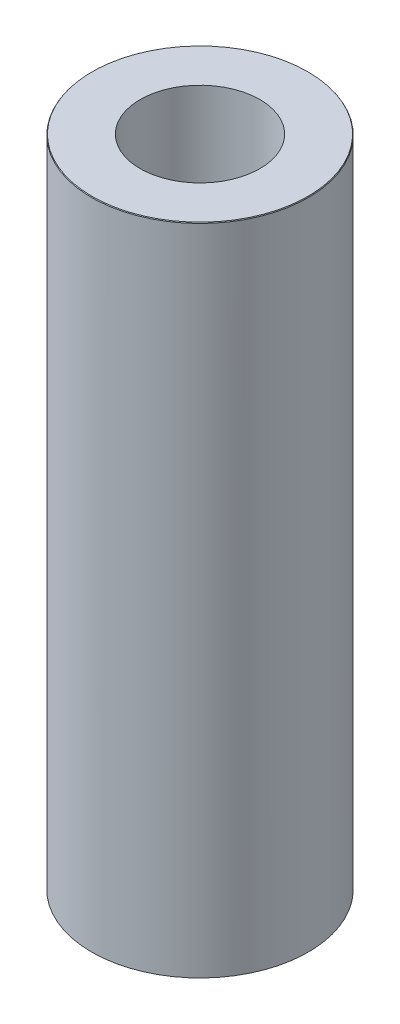
ISO-10303-21;
HEADER;
FILE_DESCRIPTION(('STEP AP214'),'2;1');
FILE_NAME('part.step','',(''),(''),'','','');
FILE_SCHEMA(('AUTOMOTIVE_DESIGN { 1 0 10303 214 1 1 1 1 }'));
ENDSEC;
DATA;
#1=APPLICATION_CONTEXT('core data for automotive mechanical design processes');
#2=APPLICATION_PROTOCOL_DEFINITION('international standard','automotive_design',2000,#1);
#3=PRODUCT_CONTEXT('',#1,'mechanical');
#4=PRODUCT('Part','Part','',(#3));
#5=PRODUCT_RELATED_PRODUCT_CATEGORY('part','',(#4));
#6=PRODUCT_DEFINITION_FORMATION('','',#4);
#7=PRODUCT_DEFINITION_CONTEXT('part definition',#1,'design');
#8=PRODUCT_DEFINITION('design','',#6,#7);
#9=PRODUCT_DEFINITION_SHAPE('','',#8);
#10=(LENGTH_UNIT() NAMED_UNIT(*) SI_UNIT(.MILLI.,.METRE.));
#11=(NAMED_UNIT(*) PLANE_ANGLE_UNIT() SI_UNIT($,.RADIAN.));
#12=(NAMED_UNIT(*) SI_UNIT($,.STERADIAN.) SOLID_ANGLE_UNIT());
#13=UNCERTAINTY_MEASURE_WITH_UNIT(LENGTH_MEASURE(1.E-05),#10,'distance_accuracy_value','');
#14=(GEOMETRIC_REPRESENTATION_CONTEXT(3) GLOBAL_UNCERTAINTY_ASSIGNED_CONTEXT((#13)) GLOBAL_UNIT_ASSIGNED_CONTEXT((#10,
#11,#12)) REPRESENTATION_CONTEXT('',''));
#15=CARTESIAN_POINT('',(0.,0.,0.));
#16=DIRECTION('',(0.,0.,1.));
#17=DIRECTION('',(1.,0.,0.));
#18=AXIS2_PLACEMENT_3D('',#15,#16,#17);
#19=CARTESIAN_POINT('',(0.,211.440433748619,0.));
#20=DIRECTION('',(0.,-1.,0.));
#21=DIRECTION('',(0.,0.,-1.));
#22=AXIS2_PLACEMENT_3D('',#19,#20,#21);
#23=CYLINDRICAL_SURFACE('',#22,35.);
#24=CARTESIAN_POINT('',(0.,211.185348429468,0.));
#25=DIRECTION('',(0.,1.,0.));
#26=DIRECTION('',(0.,0.,1.));
#27=AXIS2_PLACEMENT_3D('',#24,#25,#26);
#28=CIRCLE('',#27,35.);
#29=CARTESIAN_POINT('',(0.,211.185348429468,-35.));
#30=VERTEX_POINT('',#29);
#31=EDGE_CURVE('E50',#30,#30,#28,.F.);
#32=CARTESIAN_POINT('',(0.,0.14727357767827,0.));
#33=DIRECTION('',(0.,1.,0.));
#34=DIRECTION('',(0.,0.,1.));
#35=AXIS2_PLACEMENT_3D('',#32,#33,#34);
#36=CIRCLE('',#35,35.);
#37=CARTESIAN_POINT('',(0.,0.147273577678242,-35.));
#38=VERTEX_POINT('',#37);
#39=EDGE_CURVE('E51',#38,#38,#36,.T.);
#40=CARTESIAN_POINT('',(0.,211.185348429468,-35.));
#41=CARTESIAN_POINT('',(0.,208.987035149762,-35.));
#42=CARTESIAN_POINT('',(0.,206.788721870056,-35.));
#43=CARTESIAN_POINT('',(0.,202.392095310644,-35.));
#44=CARTESIAN_POINT('',(0.,200.193782030937,-35.));
#45=CARTESIAN_POINT('',(0.,195.797155471525,-35.));
#46=CARTESIAN_POINT('',(0.,193.598842191819,-35.));
#47=CARTESIAN_POINT('',(0.,189.202215632407,-35.));
#48=CARTESIAN_POINT('',(0.,187.003902352701,-35.));
#49=CARTESIAN_POINT('',(0.,182.607275793288,-35.));
#50=CARTESIAN_POINT('',(0.,180.408962513582,-35.));
#51=CARTESIAN_POINT('',(0.,176.01233595417,-35.));
#52=CARTESIAN_POINT('',(0.,173.814022674464,-35.));
#53=CARTESIAN_POINT('',(0.,169.417396115051,-35.));
#54=CARTESIAN_POINT('',(0.,167.219082835345,-35.));
#55=CARTESIAN_POINT('',(0.,162.822456275933,-35.));
#56=CARTESIAN_POINT('',(0.,160.624142996227,-35.));
#57=CARTESIAN_POINT('',(0.,156.227516436815,-35.));
#58=CARTESIAN_POINT('',(0.,154.029203157108,-35.));
#59=CARTESIAN_POINT('',(0.,149.632576597696,-35.));
#60=CARTESIAN_POINT('',(0.,147.43426331799,-35.));
#61=CARTESIAN_POINT('',(0.,143.037636758578,-35.));
#62=CARTESIAN_POINT('',(0.,140.839323478872,-35.));
#63=CARTESIAN_POINT('',(0.,136.442696919459,-35.));
#64=CARTESIAN_POINT('',(0.,134.244383639753,-35.));
#65=CARTESIAN_POINT('',(0.,129.847757080341,-35.));
#66=CARTESIAN_POINT('',(0.,127.649443800635,-35.));
#67=CARTESIAN_POINT('',(0.,123.252817241222,-35.));
#68=CARTESIAN_POINT('',(0.,121.054503961516,-35.));
#69=CARTESIAN_POINT('',(0.,116.657877402104,-35.));
#70=CARTESIAN_POINT('',(0.,114.459564122398,-35.));
#71=CARTESIAN_POINT('',(0.,110.062937562985,-35.));
#72=CARTESIAN_POINT('',(0.,107.864624283279,-35.));
#73=CARTESIAN_POINT('',(0.,103.467997723867,-35.));
#74=CARTESIAN_POINT('',(0.,101.269684444161,-35.));
#75=CARTESIAN_POINT('',(0.,96.8730578847486,-35.));
#76=CARTESIAN_POINT('',(0.,94.6747446050424,-35.));
#77=CARTESIAN_POINT('',(0.,90.2781180456302,-35.));
#78=CARTESIAN_POINT('',(0.,88.079804765924,-35.));
#79=CARTESIAN_POINT('',(0.,83.6831782065117,-35.));
#80=CARTESIAN_POINT('',(0.,81.4848649268056,-35.));
#81=CARTESIAN_POINT('',(0.,77.0882383673933,-35.));
#82=CARTESIAN_POINT('',(0.,74.8899250876872,-35.));
#83=CARTESIAN_POINT('',(0.,70.4932985282749,-35.));
#84=CARTESIAN_POINT('',(0.,68.2949852485687,-35.));
#85=CARTESIAN_POINT('',(0.,63.8983586891564,-35.));
#86=CARTESIAN_POINT('',(0.,61.7000454094503,-35.));
#87=CARTESIAN_POINT('',(0.,57.303418850038,-35.));
#88=CARTESIAN_POINT('',(0.,55.1051055703319,-35.));
#89=CARTESIAN_POINT('',(0.,50.7084790109196,-35.));
#90=CARTESIAN_POINT('',(0.,48.5101657312134,-35.));
#91=CARTESIAN_POINT('',(0.,44.1135391718011,-35.));
#92=CARTESIAN_POINT('',(0.,41.915225892095,-35.));
#93=CARTESIAN_POINT('',(0.,37.5185993326827,-35.));
#94=CARTESIAN_POINT('',(0.,35.3202860529765,-35.));
#95=CARTESIAN_POINT('',(0.,30.9236594935643,-35.));
#96=CARTESIAN_POINT('',(0.,28.7253462138581,-35.));
#97=CARTESIAN_POINT('',(0.,24.3287196544458,-35.));
#98=CARTESIAN_POINT('',(0.,22.1304063747397,-35.));
#99=CARTESIAN_POINT('',(0.,17.7337798153274,-35.));
#100=CARTESIAN_POINT('',(0.,15.5354665356212,-35.));
#101=CARTESIAN_POINT('',(0.,11.138839976209,-35.));
#102=CARTESIAN_POINT('',(0.,8.9405266965028,-35.));
#103=CARTESIAN_POINT('',(0.,4.54390013709051,-35.));
#104=CARTESIAN_POINT('',(0.,2.34558685738438,-35.));
#105=CARTESIAN_POINT('',(0.,0.147273577678242,-35.));
#106=B_SPLINE_CURVE_WITH_KNOTS('',3,(#40,#41,#42,#43,#44,#45,#46,#47,#48,#49,#50,#51,#52,#53,
#54,#55,#56,#57,#58,#59,#60,#61,#62,#63,#64,#65,#66,#67,#68,#69,#70,#71,#72,#73,#74,#75,#76,#77,
#78,#79,#80,#81,#82,#83,#84,#85,#86,#87,#88,#89,#90,#91,#92,#93,#94,#95,#96,#97,#98,#99,#100,
#101,#102,#103,#104,#105),.UNSPECIFIED.,.F.,.F.,(4,2,2,2,2,2,2,2,2,2,2,2,2,2,2,2,2,2,2,2,2,2,2,
2,2,2,2,2,2,2,2,2,4),(0.,6.59493983911844,13.1898796782369,19.7848195173553,26.3797593564737,
32.9746991955922,39.5696390347106,46.1645788738291,52.7595187129475,59.3544585520659,
65.9493983911844,72.5443382303028,79.1392780694212,85.7342179085397,92.3291577476581,
98.9240975867765,105.519037425895,112.113977265013,118.708917104132,125.30385694325,
131.898796782369,138.493736621487,145.088676460606,151.683616299724,158.278556138842,
164.873495977961,171.468435817079,178.063375656198,184.658315495316,191.253255334435,
197.848195173553,204.443135012671,211.03807485179),.UNSPECIFIED.);
#107=EDGE_CURVE('BSEAM39',#30,#38,#106,.T.);
#108=ORIENTED_EDGE('',*,*,#31,.T.);
#109=ORIENTED_EDGE('',*,*,#39,.T.);
#110=ORIENTED_EDGE('',*,*,#107,.T.);
#111=ORIENTED_EDGE('',*,*,#107,.F.);
#112=EDGE_LOOP('',(#108,#110,#109,#111));
#113=FACE_BOUND('',#112,.T.);
#114=ADVANCED_FACE('F39',(#113),#23,.T.);
#115=CARTESIAN_POINT('',(0.,211.440433748619,0.));
#116=DIRECTION('',(0.,1.,0.));
#117=DIRECTION('',(0.,0.,1.));
#118=AXIS2_PLACEMENT_3D('',#115,#116,#117);
#119=PLANE('',#118);
#120=CARTESIAN_POINT('',(0.,211.440433748619,0.));
#121=DIRECTION('',(0.,1.,0.));
#122=DIRECTION('',(0.,0.,1.));
#123=AXIS2_PLACEMENT_3D('',#120,#121,#122);
#124=CIRCLE('',#123,34.8527264223219);
#125=CARTESIAN_POINT('',(0.,211.440433748619,34.8527264223219));
#126=VERTEX_POINT('',#125);
#127=EDGE_CURVE('E54',#126,#126,#124,.T.);
#128=ORIENTED_EDGE('',*,*,#127,.T.);
#129=EDGE_LOOP('',(#128));
#130=FACE_BOUND('',#129,.T.);
#131=CARTESIAN_POINT('',(0.,211.440433748619,0.));
#132=DIRECTION('',(0.,1.,0.));
#133=DIRECTION('',(0.,0.,1.));
#134=AXIS2_PLACEMENT_3D('',#131,#132,#133);
#135=CIRCLE('',#134,19.3418650010805);
#136=CARTESIAN_POINT('',(0.,211.440433748619,-19.3418650010805));
#137=VERTEX_POINT('',#136);
#138=EDGE_CURVE('E58',#137,#137,#135,.T.);
#139=ORIENTED_EDGE('',*,*,#138,.F.);
#140=EDGE_LOOP('',(#139));
#141=FACE_BOUND('',#140,.T.);
#142=ADVANCED_FACE('F69',(#130,#141),#119,.T.);
#143=CARTESIAN_POINT('',(0.,0.,0.));
#144=DIRECTION('',(0.,1.,0.));
#145=DIRECTION('',(0.,0.,1.));
#146=AXIS2_PLACEMENT_3D('',#143,#144,#145);
#147=PLANE('',#146);
#148=CARTESIAN_POINT('',(0.,0.,0.));
#149=DIRECTION('',(0.,1.,0.));
#150=DIRECTION('',(0.,0.,1.));
#151=AXIS2_PLACEMENT_3D('',#148,#149,#150);
#152=CIRCLE('',#151,34.7449146808488);
#153=CARTESIAN_POINT('',(0.,0.,34.7449146808488));
#154=VERTEX_POINT('',#153);
#155=EDGE_CURVE('E10',#154,#154,#152,.F.);
#156=ORIENTED_EDGE('',*,*,#155,.T.);
#157=EDGE_LOOP('',(#156));
#158=FACE_BOUND('',#157,.T.);
#159=CARTESIAN_POINT('',(0.,0.,0.));
#160=DIRECTION('',(0.,1.,0.));
#161=DIRECTION('',(0.,0.,1.));
#162=AXIS2_PLACEMENT_3D('',#159,#160,#161);
#163=CIRCLE('',#162,19.3418650010805);
#164=CARTESIAN_POINT('',(0.,0.,-19.3418650010805));
#165=VERTEX_POINT('',#164);
#166=EDGE_CURVE('E63',#165,#165,#163,.T.);
#167=ORIENTED_EDGE('',*,*,#166,.T.);
#168=EDGE_LOOP('',(#167));
#169=FACE_BOUND('',#168,.T.);
#170=ADVANCED_FACE('F75',(#158,#169),#147,.F.);
#171=CARTESIAN_POINT('',(0.,211.440433748619,0.));
#172=DIRECTION('',(0.,-1.,0.));
#173=DIRECTION('',(0.,0.,-1.));
#174=AXIS2_PLACEMENT_3D('',#171,#172,#173);
#175=CYLINDRICAL_SURFACE('',#174,19.3418650010805);
#176=CARTESIAN_POINT('',(0.,211.440433748619,-19.3418650010805));
#177=CARTESIAN_POINT('',(0.,209.237929230404,-19.3418650010805));
#178=CARTESIAN_POINT('',(0.,207.035424712189,-19.3418650010805));
#179=CARTESIAN_POINT('',(0.,202.63041567576,-19.3418650010805));
#180=CARTESIAN_POINT('',(0.,200.427911157545,-19.3418650010805));
#181=CARTESIAN_POINT('',(0.,196.022902121116,-19.3418650010805));
#182=CARTESIAN_POINT('',(0.,193.820397602901,-19.3418650010805));
#183=CARTESIAN_POINT('',(0.,189.415388566471,-19.3418650010805));
#184=CARTESIAN_POINT('',(0.,187.212884048256,-19.3418650010805));
#185=CARTESIAN_POINT('',(0.,182.807875011827,-19.3418650010805));
#186=CARTESIAN_POINT('',(0.,180.605370493612,-19.3418650010805));
#187=CARTESIAN_POINT('',(0.,176.200361457183,-19.3418650010805));
#188=CARTESIAN_POINT('',(0.,173.997856938968,-19.3418650010805));
#189=CARTESIAN_POINT('',(0.,169.592847902538,-19.3418650010805));
#190=CARTESIAN_POINT('',(0.,167.390343384323,-19.3418650010805));
#191=CARTESIAN_POINT('',(0.,162.985334347894,-19.3418650010805));
#192=CARTESIAN_POINT('',(0.,160.782829829679,-19.3418650010805));
#193=CARTESIAN_POINT('',(0.,156.377820793249,-19.3418650010805));
#194=CARTESIAN_POINT('',(0.,154.175316275035,-19.3418650010805));
#195=CARTESIAN_POINT('',(0.,149.770307238605,-19.3418650010805));
#196=CARTESIAN_POINT('',(0.,147.56780272039,-19.3418650010805));
#197=CARTESIAN_POINT('',(0.,143.162793683961,-19.3418650010805));
#198=CARTESIAN_POINT('',(0.,140.960289165746,-19.3418650010805));
#199=CARTESIAN_POINT('',(0.,136.555280129316,-19.3418650010805));
#200=CARTESIAN_POINT('',(0.,134.352775611102,-19.3418650010805));
#201=CARTESIAN_POINT('',(0.,129.947766574672,-19.3418650010805));
#202=CARTESIAN_POINT('',(0.,127.745262056457,-19.3418650010805));
#203=CARTESIAN_POINT('',(0.,123.340253020028,-19.3418650010805));
#204=CARTESIAN_POINT('',(0.,121.137748501813,-19.3418650010805));
#205=CARTESIAN_POINT('',(0.,116.732739465383,-19.3418650010805));
#206=CARTESIAN_POINT('',(0.,114.530234947169,-19.3418650010805));
#207=CARTESIAN_POINT('',(0.,110.125225910739,-19.3418650010805));
#208=CARTESIAN_POINT('',(0.,107.922721392524,-19.3418650010805));
#209=CARTESIAN_POINT('',(0.,103.517712356095,-19.3418650010805));
#210=CARTESIAN_POINT('',(0.,101.31520783788,-19.3418650010805));
#211=CARTESIAN_POINT('',(0.,96.9101988014504,-19.3418650010805));
#212=CARTESIAN_POINT('',(0.,94.7076942832356,-19.3418650010805));
#213=CARTESIAN_POINT('',(0.,90.302685246806,-19.3418650010805));
#214=CARTESIAN_POINT('',(0.,88.1001807285913,-19.3418650010805));
#215=CARTESIAN_POINT('',(0.,83.6951716921617,-19.3418650010805));
#216=CARTESIAN_POINT('',(0.,81.4926671739469,-19.3418650010805));
#217=CARTESIAN_POINT('',(0.,77.0876581375174,-19.3418650010805));
#218=CARTESIAN_POINT('',(0.,74.8851536193026,-19.3418650010805));
#219=CARTESIAN_POINT('',(0.,70.480144582873,-19.3418650010805));
#220=CARTESIAN_POINT('',(0.,68.2776400646582,-19.3418650010805));
#221=CARTESIAN_POINT('',(0.,63.8726310282287,-19.3418650010805));
#222=CARTESIAN_POINT('',(0.,61.6701265100139,-19.3418650010805));
#223=CARTESIAN_POINT('',(0.,57.2651174735843,-19.3418650010805));
#224=CARTESIAN_POINT('',(0.,55.0626129553696,-19.3418650010805));
#225=CARTESIAN_POINT('',(0.,50.65760391894,-19.3418650010805));
#226=CARTESIAN_POINT('',(0.,48.4550994007252,-19.3418650010805));
#227=CARTESIAN_POINT('',(0.,44.0500903642957,-19.3418650010805));
#228=CARTESIAN_POINT('',(0.,41.8475858460809,-19.3418650010805));
#229=CARTESIAN_POINT('',(0.,37.4425768096513,-19.3418650010805));
#230=CARTESIAN_POINT('',(0.,35.2400722914365,-19.3418650010805));
#231=CARTESIAN_POINT('',(0.,30.8350632550069,-19.3418650010805));
#232=CARTESIAN_POINT('',(0.,28.6325587367922,-19.3418650010805));
#233=CARTESIAN_POINT('',(0.,24.2275497003626,-19.3418650010805));
#234=CARTESIAN_POINT('',(0.,22.0250451821478,-19.3418650010805));
#235=CARTESIAN_POINT('',(0.,17.6200361457183,-19.3418650010805));
#236=CARTESIAN_POINT('',(0.,15.4175316275035,-19.3418650010805));
#237=CARTESIAN_POINT('',(0.,11.0125225910739,-19.3418650010805));
#238=CARTESIAN_POINT('',(0.,8.81001807285912,-19.3418650010805));
#239=CARTESIAN_POINT('',(0.,4.40500903642956,-19.3418650010805));
#240=CARTESIAN_POINT('',(0.,2.20250451821478,-19.3418650010805));
#241=CARTESIAN_POINT('',(0.,0.,-19.3418650010805));
#242=B_SPLINE_CURVE_WITH_KNOTS('',3,(#176,#177,#178,#179,#180,#181,#182,#183,#184,#185,#186,
#187,#188,#189,#190,#191,#192,#193,#194,#195,#196,#197,#198,#199,#200,#201,#202,#203,#204,#205,
#206,#207,#208,#209,#210,#211,#212,#213,#214,#215,#216,#217,#218,#219,#220,#221,#222,#223,#224,
#225,#226,#227,#228,#229,#230,#231,#232,#233,#234,#235,#236,#237,#238,#239,#240,#241),
.UNSPECIFIED.,.F.,.F.,(4,2,2,2,2,2,2,2,2,2,2,2,2,2,2,2,2,2,2,2,2,2,2,2,2,2,2,2,2,2,2,2,4),(0.,
6.60751355464437,13.2150271092887,19.822540663933,26.4300542185774,33.0375677732217,
39.6450813278661,46.2525948825104,52.8601084371548,59.4676219917991,66.0751355464435,
72.6826491010878,79.2901626557322,85.8976762103765,92.5051897650209,99.1127033196652,
105.72021687431,112.327730428954,118.935243983598,125.542757538243,132.150271092887,
138.757784647531,145.365298202176,151.97281175682,158.580325311464,165.187838866109,
171.795352420753,178.402865975397,185.010379530042,191.617893084686,198.22540663933,
204.832920193975,211.440433748619),.UNSPECIFIED.);
#243=EDGE_CURVE('BSEAM70',#137,#165,#242,.T.);
#244=ORIENTED_EDGE('',*,*,#138,.T.);
#245=ORIENTED_EDGE('',*,*,#166,.F.);
#246=ORIENTED_EDGE('',*,*,#243,.T.);
#247=ORIENTED_EDGE('',*,*,#243,.F.);
#248=EDGE_LOOP('',(#244,#246,#245,#247));
#249=FACE_BOUND('',#248,.T.);
#250=ADVANCED_FACE('F70',(#249),#175,.F.);
#251=CARTESIAN_POINT('',(0.,211.440433748619,0.));
#252=DIRECTION('',(0.,-1.,0.));
#253=DIRECTION('',(0.,0.,-1.));
#254=AXIS2_PLACEMENT_3D('',#251,#252,#253);
#255=CONICAL_SURFACE('',#254,34.8527264223219,0.52359877559832);
#256=ORIENTED_EDGE('',*,*,#31,.F.);
#257=EDGE_LOOP('',(#256));
#258=FACE_BOUND('',#257,.T.);
#259=ORIENTED_EDGE('',*,*,#127,.F.);
#260=EDGE_LOOP('',(#259));
#261=FACE_BOUND('',#260,.T.);
#262=ADVANCED_FACE('F81',(#258,#261),#255,.T.);
#263=CARTESIAN_POINT('',(0.,0.14727357767827,0.));
#264=DIRECTION('',(0.,1.,0.));
#265=DIRECTION('',(0.,0.,1.));
#266=AXIS2_PLACEMENT_3D('',#263,#264,#265);
#267=CONICAL_SURFACE('',#266,35.,1.04719755119669);
#268=ORIENTED_EDGE('',*,*,#155,.F.);
#269=EDGE_LOOP('',(#268));
#270=FACE_BOUND('',#269,.T.);
#271=ORIENTED_EDGE('',*,*,#39,.F.);
#272=EDGE_LOOP('',(#271));
#273=FACE_BOUND('',#272,.T.);
#274=ADVANCED_FACE('F45',(#270,#273),#267,.T.);
#275=CLOSED_SHELL('',(#114,#142,#170,#250,#262,#274));
#276=MANIFOLD_SOLID_BREP('B2',#275);
#277=ADVANCED_BREP_SHAPE_REPRESENTATION('',(#18,#276),#14);
#278=SHAPE_DEFINITION_REPRESENTATION(#9,#277);
ENDSEC;
END-ISO-10303-21;
